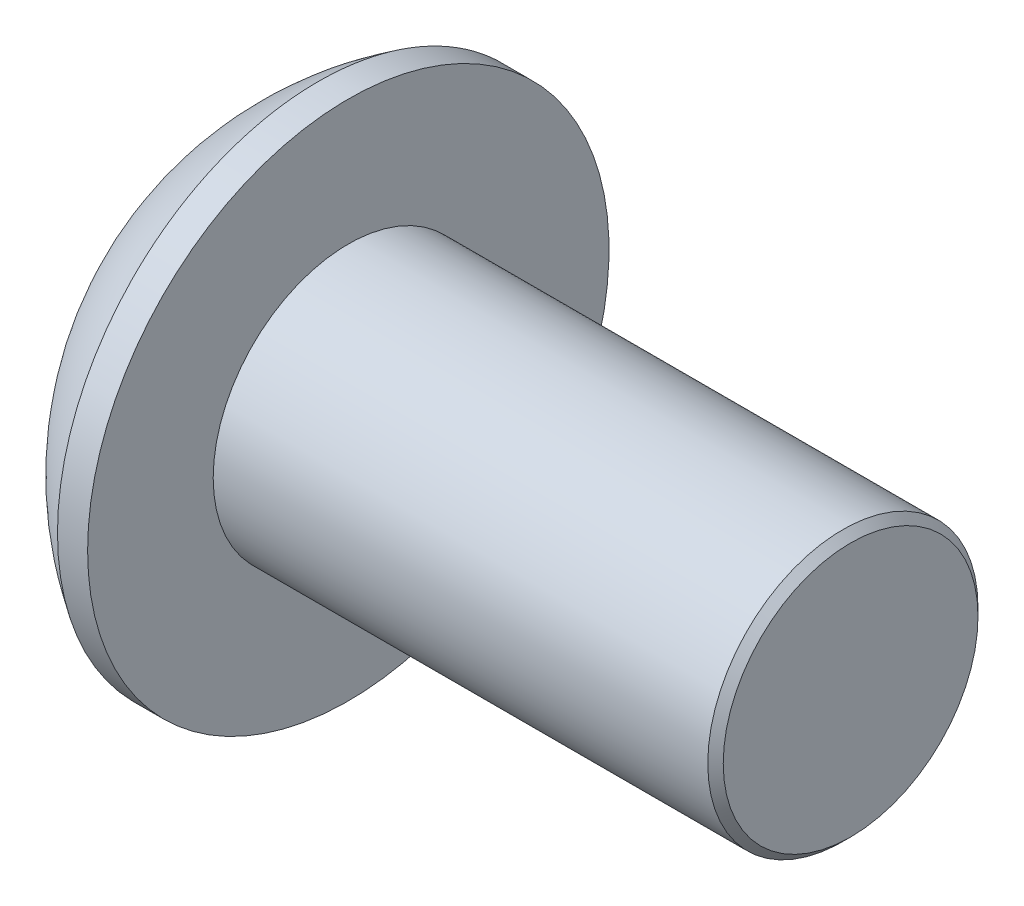
ISO-10303-21;
HEADER;
FILE_DESCRIPTION(('STEP AP214'),'2;1');
FILE_NAME('part.step','',(''),(''),'','','');
FILE_SCHEMA(('AUTOMOTIVE_DESIGN { 1 0 10303 214 1 1 1 1 }'));
ENDSEC;
DATA;
#1=APPLICATION_CONTEXT('core data for automotive mechanical design processes');
#2=APPLICATION_PROTOCOL_DEFINITION('international standard','automotive_design',2000,#1);
#3=PRODUCT_CONTEXT('',#1,'mechanical');
#4=PRODUCT('Part','Part','',(#3));
#5=PRODUCT_RELATED_PRODUCT_CATEGORY('part','',(#4));
#6=PRODUCT_DEFINITION_FORMATION('','',#4);
#7=PRODUCT_DEFINITION_CONTEXT('part definition',#1,'design');
#8=PRODUCT_DEFINITION('design','',#6,#7);
#9=PRODUCT_DEFINITION_SHAPE('','',#8);
#10=(LENGTH_UNIT() NAMED_UNIT(*) SI_UNIT(.MILLI.,.METRE.));
#11=(NAMED_UNIT(*) PLANE_ANGLE_UNIT() SI_UNIT($,.RADIAN.));
#12=(NAMED_UNIT(*) SI_UNIT($,.STERADIAN.) SOLID_ANGLE_UNIT());
#13=UNCERTAINTY_MEASURE_WITH_UNIT(LENGTH_MEASURE(1.E-05),#10,'distance_accuracy_value','');
#14=(GEOMETRIC_REPRESENTATION_CONTEXT(3) GLOBAL_UNCERTAINTY_ASSIGNED_CONTEXT((#13)) GLOBAL_UNIT_ASSIGNED_CONTEXT((#10,
#11,#12)) REPRESENTATION_CONTEXT('',''));
#15=CARTESIAN_POINT('',(0.,0.,0.));
#16=DIRECTION('',(0.,0.,1.));
#17=DIRECTION('',(1.,0.,0.));
#18=AXIS2_PLACEMENT_3D('',#15,#16,#17);
#19=CARTESIAN_POINT('',(1.32080000000034,0.,0.));
#20=DIRECTION('',(-1.,0.,0.));
#21=DIRECTION('',(0.,0.,1.));
#22=AXIS2_PLACEMENT_3D('',#19,#20,#21);
#23=CONICAL_SURFACE('',#22,1.1937999999998,1.04719755119608);
#24=CARTESIAN_POINT('',(2.01004075135902,0.,4.44089209850063E-13));
#25=VERTEX_POINT('',#24);
#26=VERTEX_LOOP('',#25);
#27=FACE_BOUND('',#26,.T.);
#28=CARTESIAN_POINT('',(1.32080000000009,0.,0.));
#29=DIRECTION('',(-1.,0.,0.));
#30=DIRECTION('',(0.,0.,1.));
#31=AXIS2_PLACEMENT_3D('',#28,#29,#30);
#32=CIRCLE('',#31,1.19380000000024);
#33=CARTESIAN_POINT('',(1.32080000000004,-1.03386112703797,0.59690000000006));
#34=VERTEX_POINT('',#33);
#35=CARTESIAN_POINT('',(1.32080000000004,0.,1.19380000000012));
#36=VERTEX_POINT('',#35);
#37=EDGE_CURVE('E20',#34,#36,#32,.T.);
#38=ORIENTED_EDGE('',*,*,#37,.T.);
#39=CARTESIAN_POINT('',(1.32080000000009,0.,0.));
#40=DIRECTION('',(-1.,0.,0.));
#41=DIRECTION('',(0.,0.,1.));
#42=AXIS2_PLACEMENT_3D('',#39,#40,#41);
#43=CIRCLE('',#42,1.19380000000024);
#44=CARTESIAN_POINT('',(1.32080000000004,1.03386112703797,0.596900000000061));
#45=VERTEX_POINT('',#44);
#46=EDGE_CURVE('E148',#36,#45,#43,.T.);
#47=ORIENTED_EDGE('',*,*,#46,.T.);
#48=CARTESIAN_POINT('',(1.32080000000009,0.,0.));
#49=DIRECTION('',(-1.,0.,0.));
#50=DIRECTION('',(0.,0.,1.));
#51=AXIS2_PLACEMENT_3D('',#48,#49,#50);
#52=CIRCLE('',#51,1.19380000000024);
#53=CARTESIAN_POINT('',(1.32080000000004,1.03386112703797,-0.596900000000061));
#54=VERTEX_POINT('',#53);
#55=EDGE_CURVE('E403',#45,#54,#52,.T.);
#56=ORIENTED_EDGE('',*,*,#55,.T.);
#57=CARTESIAN_POINT('',(1.32080000000009,0.,0.));
#58=DIRECTION('',(-1.,0.,0.));
#59=DIRECTION('',(0.,0.,1.));
#60=AXIS2_PLACEMENT_3D('',#57,#58,#59);
#61=CIRCLE('',#60,1.19380000000024);
#62=CARTESIAN_POINT('',(1.32080000000004,1.49457637585666E-12,-1.19380000000012));
#63=VERTEX_POINT('',#62);
#64=EDGE_CURVE('E404',#54,#63,#61,.T.);
#65=ORIENTED_EDGE('',*,*,#64,.T.);
#66=CARTESIAN_POINT('',(1.32080000000009,0.,0.));
#67=DIRECTION('',(-1.,0.,0.));
#68=DIRECTION('',(0.,0.,1.));
#69=AXIS2_PLACEMENT_3D('',#66,#67,#68);
#70=CIRCLE('',#69,1.19380000000024);
#71=CARTESIAN_POINT('',(1.32080000000004,-1.03386112703797,-0.59690000000006));
#72=VERTEX_POINT('',#71);
#73=EDGE_CURVE('E93',#63,#72,#70,.T.);
#74=ORIENTED_EDGE('',*,*,#73,.T.);
#75=CARTESIAN_POINT('',(1.32080000000009,0.,0.));
#76=DIRECTION('',(-1.,0.,0.));
#77=DIRECTION('',(0.,0.,1.));
#78=AXIS2_PLACEMENT_3D('',#75,#76,#77);
#79=CIRCLE('',#78,1.19380000000024);
#80=EDGE_CURVE('E89',#72,#34,#79,.T.);
#81=ORIENTED_EDGE('',*,*,#80,.T.);
#82=EDGE_LOOP('',(#38,#47,#56,#65,#74,#81));
#83=FACE_BOUND('',#82,.T.);
#84=ADVANCED_FACE('F17',(#27,#83),#23,.F.);
#85=CARTESIAN_POINT('',(1.3208,-2.06772225407572,-1.1938));
#86=DIRECTION('',(1.,0.,0.));
#87=DIRECTION('',(0.,0.,-1.));
#88=AXIS2_PLACEMENT_3D('',#85,#86,#87);
#89=PLANE('',#88);
#90=DIRECTION('',(0.,0.5,0.866025403784439));
#91=VECTOR('',#90,1.);
#92=CARTESIAN_POINT('',(1.3208,-1.37848150271715,0.));
#93=LINE('',#92,#91);
#94=CARTESIAN_POINT('',(1.3208,-0.689240751358574,1.1938));
#95=VERTEX_POINT('',#94);
#96=EDGE_CURVE('E101',#95,#34,#93,.F.);
#97=ORIENTED_EDGE('',*,*,#96,.F.);
#98=DIRECTION('',(0.,1.,0.));
#99=VECTOR('',#98,1.);
#100=CARTESIAN_POINT('',(1.3208,-0.689240751358574,1.1938));
#101=LINE('',#100,#99);
#102=EDGE_CURVE('E103',#36,#95,#101,.F.);
#103=ORIENTED_EDGE('',*,*,#102,.F.);
#104=ORIENTED_EDGE('',*,*,#37,.F.);
#105=EDGE_LOOP('',(#97,#103,#104));
#106=FACE_BOUND('',#105,.T.);
#107=ADVANCED_FACE('F99',(#106),#89,.F.);
#108=CARTESIAN_POINT('',(1.3208,-2.06772225407572,-1.1938));
#109=DIRECTION('',(1.,0.,0.));
#110=DIRECTION('',(0.,0.,-1.));
#111=AXIS2_PLACEMENT_3D('',#108,#109,#110);
#112=PLANE('',#111);
#113=DIRECTION('',(0.,-0.5,0.866025403784439));
#114=VECTOR('',#113,1.);
#115=CARTESIAN_POINT('',(1.3208,-0.689240751358574,-1.1938));
#116=LINE('',#115,#114);
#117=CARTESIAN_POINT('',(1.3208,-1.37848150271715,0.));
#118=VERTEX_POINT('',#117);
#119=EDGE_CURVE('E109',#118,#72,#116,.F.);
#120=ORIENTED_EDGE('',*,*,#119,.F.);
#121=DIRECTION('',(0.,0.5,0.866025403784439));
#122=VECTOR('',#121,1.);
#123=CARTESIAN_POINT('',(1.3208,-1.37848150271715,0.));
#124=LINE('',#123,#122);
#125=EDGE_CURVE('E106',#34,#118,#124,.F.);
#126=ORIENTED_EDGE('',*,*,#125,.F.);
#127=ORIENTED_EDGE('',*,*,#80,.F.);
#128=EDGE_LOOP('',(#120,#126,#127));
#129=FACE_BOUND('',#128,.T.);
#130=ADVANCED_FACE('F107',(#129),#112,.F.);
#131=CARTESIAN_POINT('',(1.3208,-2.06772225407572,-1.1938));
#132=DIRECTION('',(1.,0.,0.));
#133=DIRECTION('',(0.,0.,-1.));
#134=AXIS2_PLACEMENT_3D('',#131,#132,#133);
#135=PLANE('',#134);
#136=DIRECTION('',(0.,1.,0.));
#137=VECTOR('',#136,1.);
#138=CARTESIAN_POINT('',(1.3208,0.689240751358577,-1.1938));
#139=LINE('',#138,#137);
#140=CARTESIAN_POINT('',(1.3208,-0.689240751358574,-1.1938));
#141=VERTEX_POINT('',#140);
#142=EDGE_CURVE('E374',#141,#63,#139,.T.);
#143=ORIENTED_EDGE('',*,*,#142,.F.);
#144=DIRECTION('',(0.,-0.5,0.866025403784439));
#145=VECTOR('',#144,1.);
#146=CARTESIAN_POINT('',(1.3208,-0.689240751358574,-1.1938));
#147=LINE('',#146,#145);
#148=EDGE_CURVE('E386',#72,#141,#147,.F.);
#149=ORIENTED_EDGE('',*,*,#148,.F.);
#150=ORIENTED_EDGE('',*,*,#73,.F.);
#151=EDGE_LOOP('',(#143,#149,#150));
#152=FACE_BOUND('',#151,.T.);
#153=ADVANCED_FACE('F191',(#152),#135,.F.);
#154=CARTESIAN_POINT('',(1.3208,-2.06772225407572,-1.1938));
#155=DIRECTION('',(1.,0.,0.));
#156=DIRECTION('',(0.,0.,-1.));
#157=AXIS2_PLACEMENT_3D('',#154,#155,#156);
#158=PLANE('',#157);
#159=DIRECTION('',(0.,-0.5,-0.866025403784439));
#160=VECTOR('',#159,1.);
#161=CARTESIAN_POINT('',(1.3208,1.37848150271715,0.));
#162=LINE('',#161,#160);
#163=CARTESIAN_POINT('',(1.3208,0.689240751358577,-1.1938));
#164=VERTEX_POINT('',#163);
#165=EDGE_CURVE('E360',#164,#54,#162,.F.);
#166=ORIENTED_EDGE('',*,*,#165,.F.);
#167=DIRECTION('',(0.,1.,0.));
#168=VECTOR('',#167,1.);
#169=CARTESIAN_POINT('',(1.3208,0.689240751358577,-1.1938));
#170=LINE('',#169,#168);
#171=EDGE_CURVE('E371',#63,#164,#170,.T.);
#172=ORIENTED_EDGE('',*,*,#171,.F.);
#173=ORIENTED_EDGE('',*,*,#64,.F.);
#174=EDGE_LOOP('',(#166,#172,#173));
#175=FACE_BOUND('',#174,.T.);
#176=ADVANCED_FACE('F187',(#175),#158,.F.);
#177=CARTESIAN_POINT('',(1.3208,-2.06772225407572,-1.1938));
#178=DIRECTION('',(1.,0.,0.));
#179=DIRECTION('',(0.,0.,-1.));
#180=AXIS2_PLACEMENT_3D('',#177,#178,#179);
#181=PLANE('',#180);
#182=DIRECTION('',(0.,0.5,-0.866025403784439));
#183=VECTOR('',#182,1.);
#184=CARTESIAN_POINT('',(1.3208,0.689240751358576,1.1938));
#185=LINE('',#184,#183);
#186=CARTESIAN_POINT('',(1.3208,1.37848150271715,0.));
#187=VERTEX_POINT('',#186);
#188=EDGE_CURVE('E339',#187,#45,#185,.F.);
#189=ORIENTED_EDGE('',*,*,#188,.F.);
#190=DIRECTION('',(0.,-0.5,-0.866025403784439));
#191=VECTOR('',#190,1.);
#192=CARTESIAN_POINT('',(1.3208,1.37848150271715,0.));
#193=LINE('',#192,#191);
#194=EDGE_CURVE('E358',#54,#187,#193,.F.);
#195=ORIENTED_EDGE('',*,*,#194,.F.);
#196=ORIENTED_EDGE('',*,*,#55,.F.);
#197=EDGE_LOOP('',(#189,#195,#196));
#198=FACE_BOUND('',#197,.T.);
#199=ADVANCED_FACE('F183',(#198),#181,.F.);
#200=CARTESIAN_POINT('',(1.3208,-2.06772225407572,-1.1938));
#201=DIRECTION('',(1.,0.,0.));
#202=DIRECTION('',(0.,0.,-1.));
#203=AXIS2_PLACEMENT_3D('',#200,#201,#202);
#204=PLANE('',#203);
#205=DIRECTION('',(0.,1.,0.));
#206=VECTOR('',#205,1.);
#207=CARTESIAN_POINT('',(1.3208,-0.689240751358574,1.1938));
#208=LINE('',#207,#206);
#209=CARTESIAN_POINT('',(1.3208,0.689240751358576,1.1938));
#210=VERTEX_POINT('',#209);
#211=EDGE_CURVE('E118',#210,#36,#208,.F.);
#212=ORIENTED_EDGE('',*,*,#211,.F.);
#213=DIRECTION('',(0.,0.5,-0.866025403784439));
#214=VECTOR('',#213,1.);
#215=CARTESIAN_POINT('',(1.3208,0.689240751358576,1.1938));
#216=LINE('',#215,#214);
#217=EDGE_CURVE('E342',#45,#210,#216,.F.);
#218=ORIENTED_EDGE('',*,*,#217,.F.);
#219=ORIENTED_EDGE('',*,*,#46,.F.);
#220=EDGE_LOOP('',(#212,#218,#219));
#221=FACE_BOUND('',#220,.T.);
#222=ADVANCED_FACE('F179',(#221),#204,.F.);
#223=CARTESIAN_POINT('',(1.3208,-0.689240751358574,1.1938));
#224=DIRECTION('',(0.,0.,-1.));
#225=DIRECTION('',(0.,1.,0.));
#226=AXIS2_PLACEMENT_3D('',#223,#224,#225);
#227=PLANE('',#226);
#228=DIRECTION('',(0.,1.,0.));
#229=VECTOR('',#228,1.);
#230=CARTESIAN_POINT('',(0.,0.,1.1938));
#231=LINE('',#230,#229);
#232=CARTESIAN_POINT('',(0.,0.689240751358577,1.1938));
#233=VERTEX_POINT('',#232);
#234=CARTESIAN_POINT('',(0.,-0.689240751358574,1.1938));
#235=VERTEX_POINT('',#234);
#236=EDGE_CURVE('E336',#233,#235,#231,.F.);
#237=ORIENTED_EDGE('',*,*,#236,.F.);
#238=DIRECTION('',(1.,0.,0.));
#239=VECTOR('',#238,1.);
#240=CARTESIAN_POINT('',(1.3208,0.689240751358576,1.1938));
#241=LINE('',#240,#239);
#242=EDGE_CURVE('E348',#210,#233,#241,.F.);
#243=ORIENTED_EDGE('',*,*,#242,.F.);
#244=ORIENTED_EDGE('',*,*,#211,.T.);
#245=ORIENTED_EDGE('',*,*,#102,.T.);
#246=DIRECTION('',(1.,0.,0.));
#247=VECTOR('',#246,1.);
#248=CARTESIAN_POINT('',(1.3208,-0.689240751358574,1.1938));
#249=LINE('',#248,#247);
#250=EDGE_CURVE('E112',#235,#95,#249,.T.);
#251=ORIENTED_EDGE('',*,*,#250,.F.);
#252=EDGE_LOOP('',(#237,#243,#244,#245,#251));
#253=FACE_BOUND('',#252,.T.);
#254=ADVANCED_FACE('F176',(#253),#227,.T.);
#255=CARTESIAN_POINT('',(1.3208,-1.37848150271715,0.));
#256=DIRECTION('',(0.,0.866025403784439,-0.5));
#257=DIRECTION('',(0.,0.5,0.866025403784439));
#258=AXIS2_PLACEMENT_3D('',#255,#256,#257);
#259=PLANE('',#258);
#260=DIRECTION('',(0.,-0.5,-0.866025403784439));
#261=VECTOR('',#260,1.);
#262=CARTESIAN_POINT('',(0.,-0.689240751358574,1.1938));
#263=LINE('',#262,#261);
#264=CARTESIAN_POINT('',(0.,-1.37848150271715,0.));
#265=VERTEX_POINT('',#264);
#266=EDGE_CURVE('E333',#235,#265,#263,.T.);
#267=ORIENTED_EDGE('',*,*,#266,.F.);
#268=ORIENTED_EDGE('',*,*,#250,.T.);
#269=ORIENTED_EDGE('',*,*,#96,.T.);
#270=ORIENTED_EDGE('',*,*,#125,.T.);
#271=DIRECTION('',(1.,0.,0.));
#272=VECTOR('',#271,1.);
#273=CARTESIAN_POINT('',(1.3208,-1.37848150271715,0.));
#274=LINE('',#273,#272);
#275=EDGE_CURVE('E383',#265,#118,#274,.T.);
#276=ORIENTED_EDGE('',*,*,#275,.F.);
#277=EDGE_LOOP('',(#267,#268,#269,#270,#276));
#278=FACE_BOUND('',#277,.T.);
#279=ADVANCED_FACE('F116',(#278),#259,.T.);
#280=CARTESIAN_POINT('',(1.3208,-0.689240751358574,-1.1938));
#281=DIRECTION('',(0.,0.866025403784439,0.5));
#282=DIRECTION('',(0.,-0.5,0.866025403784439));
#283=AXIS2_PLACEMENT_3D('',#280,#281,#282);
#284=PLANE('',#283);
#285=DIRECTION('',(0.,0.5,-0.866025403784439));
#286=VECTOR('',#285,1.);
#287=CARTESIAN_POINT('',(0.,-1.37848150271715,0.));
#288=LINE('',#287,#286);
#289=CARTESIAN_POINT('',(0.,-0.689240751358574,-1.1938));
#290=VERTEX_POINT('',#289);
#291=EDGE_CURVE('E330',#265,#290,#288,.T.);
#292=ORIENTED_EDGE('',*,*,#291,.F.);
#293=ORIENTED_EDGE('',*,*,#275,.T.);
#294=ORIENTED_EDGE('',*,*,#119,.T.);
#295=ORIENTED_EDGE('',*,*,#148,.T.);
#296=DIRECTION('',(1.,0.,0.));
#297=VECTOR('',#296,1.);
#298=CARTESIAN_POINT('',(1.3208,-0.689240751358574,-1.1938));
#299=LINE('',#298,#297);
#300=EDGE_CURVE('E368',#290,#141,#299,.T.);
#301=ORIENTED_EDGE('',*,*,#300,.F.);
#302=EDGE_LOOP('',(#292,#293,#294,#295,#301));
#303=FACE_BOUND('',#302,.T.);
#304=ADVANCED_FACE('F169',(#303),#284,.T.);
#305=CARTESIAN_POINT('',(1.3208,0.689240751358577,-1.1938));
#306=DIRECTION('',(0.,0.,1.));
#307=DIRECTION('',(1.,0.,0.));
#308=AXIS2_PLACEMENT_3D('',#305,#306,#307);
#309=PLANE('',#308);
#310=DIRECTION('',(0.,1.,0.));
#311=VECTOR('',#310,1.);
#312=CARTESIAN_POINT('',(0.,0.,-1.1938));
#313=LINE('',#312,#311);
#314=CARTESIAN_POINT('',(0.,0.689240751358577,-1.1938));
#315=VERTEX_POINT('',#314);
#316=EDGE_CURVE('E327',#290,#315,#313,.T.);
#317=ORIENTED_EDGE('',*,*,#316,.F.);
#318=ORIENTED_EDGE('',*,*,#300,.T.);
#319=ORIENTED_EDGE('',*,*,#142,.T.);
#320=ORIENTED_EDGE('',*,*,#171,.T.);
#321=DIRECTION('',(1.,0.,0.));
#322=VECTOR('',#321,1.);
#323=CARTESIAN_POINT('',(1.3208,0.689240751358577,-1.1938));
#324=LINE('',#323,#322);
#325=EDGE_CURVE('E343',#315,#164,#324,.T.);
#326=ORIENTED_EDGE('',*,*,#325,.F.);
#327=EDGE_LOOP('',(#317,#318,#319,#320,#326));
#328=FACE_BOUND('',#327,.T.);
#329=ADVANCED_FACE('F166',(#328),#309,.T.);
#330=CARTESIAN_POINT('',(1.3208,1.37848150271715,0.));
#331=DIRECTION('',(0.,-0.866025403784439,0.5));
#332=DIRECTION('',(0.,-0.5,-0.866025403784439));
#333=AXIS2_PLACEMENT_3D('',#330,#331,#332);
#334=PLANE('',#333);
#335=DIRECTION('',(0.,0.5,0.866025403784439));
#336=VECTOR('',#335,1.);
#337=CARTESIAN_POINT('',(0.,0.689240751358577,-1.1938));
#338=LINE('',#337,#336);
#339=CARTESIAN_POINT('',(0.,1.37848150271715,0.));
#340=VERTEX_POINT('',#339);
#341=EDGE_CURVE('E324',#315,#340,#338,.T.);
#342=ORIENTED_EDGE('',*,*,#341,.F.);
#343=ORIENTED_EDGE('',*,*,#325,.T.);
#344=ORIENTED_EDGE('',*,*,#165,.T.);
#345=ORIENTED_EDGE('',*,*,#194,.T.);
#346=DIRECTION('',(1.,0.,0.));
#347=VECTOR('',#346,1.);
#348=CARTESIAN_POINT('',(1.3208,1.37848150271715,0.));
#349=LINE('',#348,#347);
#350=EDGE_CURVE('E35',#340,#187,#349,.T.);
#351=ORIENTED_EDGE('',*,*,#350,.F.);
#352=EDGE_LOOP('',(#342,#343,#344,#345,#351));
#353=FACE_BOUND('',#352,.T.);
#354=ADVANCED_FACE('F162',(#353),#334,.T.);
#355=CARTESIAN_POINT('',(1.3208,0.689240751358576,1.1938));
#356=DIRECTION('',(0.,-0.866025403784439,-0.5));
#357=DIRECTION('',(0.,0.5,-0.866025403784439));
#358=AXIS2_PLACEMENT_3D('',#355,#356,#357);
#359=PLANE('',#358);
#360=DIRECTION('',(0.,-0.5,0.866025403784439));
#361=VECTOR('',#360,1.);
#362=CARTESIAN_POINT('',(0.,1.37848150271715,0.));
#363=LINE('',#362,#361);
#364=EDGE_CURVE('E147',#340,#233,#363,.T.);
#365=ORIENTED_EDGE('',*,*,#364,.F.);
#366=ORIENTED_EDGE('',*,*,#350,.T.);
#367=ORIENTED_EDGE('',*,*,#188,.T.);
#368=ORIENTED_EDGE('',*,*,#217,.T.);
#369=ORIENTED_EDGE('',*,*,#242,.T.);
#370=EDGE_LOOP('',(#365,#366,#367,#368,#369));
#371=FACE_BOUND('',#370,.T.);
#372=ADVANCED_FACE('F158',(#371),#359,.T.);
#373=CARTESIAN_POINT('',(0.,0.,0.));
#374=DIRECTION('',(-1.,0.,0.));
#375=DIRECTION('',(0.,0.,1.));
#376=AXIS2_PLACEMENT_3D('',#373,#374,#375);
#377=PLANE('',#376);
#378=ORIENTED_EDGE('',*,*,#341,.T.);
#379=ORIENTED_EDGE('',*,*,#364,.T.);
#380=ORIENTED_EDGE('',*,*,#236,.T.);
#381=ORIENTED_EDGE('',*,*,#266,.T.);
#382=ORIENTED_EDGE('',*,*,#291,.T.);
#383=ORIENTED_EDGE('',*,*,#316,.T.);
#384=EDGE_LOOP('',(#378,#379,#380,#381,#382,#383));
#385=FACE_BOUND('',#384,.T.);
#386=CARTESIAN_POINT('',(0.,1.647825,0.));
#387=CARTESIAN_POINT('',(1.63319194702151E-13,1.64781976319874,0.092490203977753));
#388=CARTESIAN_POINT('',(1.32890083579297E-13,1.63999511633709,0.18514501432637));
#389=CARTESIAN_POINT('',(0.,1.6167119250047,0.322075808080013));
#390=CARTESIAN_POINT('',(-1.58500729597375E-13,1.60700618770234,0.36743553339636));
#391=CARTESIAN_POINT('',(1.59063479291743E-13,1.58380101865853,0.45722093569514));
#392=CARTESIAN_POINT('',(5.6924253476393E-13,1.5702985083103,0.501645823115263));
#393=CARTESIAN_POINT('',(9.37393023603841E-13,1.52428156574313,0.632817459278967));
#394=CARTESIAN_POINT('',(0.,1.48621992666366,0.717681965518643));
#395=CARTESIAN_POINT('',(0.,1.39637079695658,0.879809706624016));
#396=CARTESIAN_POINT('',(7.82184274151218E-13,1.34458278455109,0.957072652379995));
#397=CARTESIAN_POINT('',(4.86982737501784E-13,1.25777784714521,1.06558770210237));
#398=CARTESIAN_POINT('',(1.33453761487452E-13,1.22729946114794,1.10054993332365));
#399=CARTESIAN_POINT('',(-1.3289162015903E-13,1.16354004969106,1.16775237388221));
#400=CARTESIAN_POINT('',(0.,1.13026175473033,1.19999517515816));
#401=CARTESIAN_POINT('',(0.,1.02649304340867,1.29236218866442));
#402=CARTESIAN_POINT('',(0.,0.952049986714077,1.34814848277712));
#403=CARTESIAN_POINT('',(0.,0.794895196754067,1.44639825105765));
#404=CARTESIAN_POINT('',(0.,0.712183775431296,1.48886222758992));
#405=CARTESIAN_POINT('',(0.,0.540796624265731,1.55930919813143));
#406=CARTESIAN_POINT('',(0.,0.452120958135287,1.58729234680268));
#407=CARTESIAN_POINT('',(0.,0.271332331080319,1.62797191307413));
#408=CARTESIAN_POINT('',(0.,0.179219351801791,1.64066824903626));
#409=CARTESIAN_POINT('',(0.,-0.0058307702784061,1.65041748705408));
#410=CARTESIAN_POINT('',(0.,-0.0987679130800752,1.64747038910978));
#411=CARTESIAN_POINT('',(0.,-0.282830196388822,1.62601274134435));
#412=CARTESIAN_POINT('',(0.,-0.373955346570016,1.60750227463794));
#413=CARTESIAN_POINT('',(0.,-0.551796068178801,1.55545413364523));
#414=CARTESIAN_POINT('',(0.,-0.638511592498163,1.52191629885843));
#415=CARTESIAN_POINT('',(0.,-0.805120175533149,1.44072378052346));
#416=CARTESIAN_POINT('',(0.,-0.885012976819951,1.39306856461393));
#417=CARTESIAN_POINT('',(0.,-0.997912879588355,1.31211658756413));
#418=CARTESIAN_POINT('',(0.,-1.0343949246834,1.28354906167734));
#419=CARTESIAN_POINT('',(0.,-1.10486279842068,1.22341829303709));
#420=CARTESIAN_POINT('',(0.,-1.13884618403291,1.19185218578117));
#421=CARTESIAN_POINT('',(0.,-1.23657300939908,1.09305906467359));
#422=CARTESIAN_POINT('',(0.,-1.29619288399356,1.02166556658612));
#423=CARTESIAN_POINT('',(0.,-1.40258050817755,0.869876423478031));
#424=CARTESIAN_POINT('',(0.,-1.44934874627766,0.789481120793477));
#425=CARTESIAN_POINT('',(0.,-1.50889406070375,0.66387095931334));
#426=CARTESIAN_POINT('',(0.,-1.52698985473586,0.621110806760426));
#427=CARTESIAN_POINT('',(0.,-1.55950093966664,0.53426077686433));
#428=CARTESIAN_POINT('',(-1.05235362596779E-13,-1.57391920916438,0.490172008203167));
#429=CARTESIAN_POINT('',(2.10568324685354E-13,-1.61146177909579,0.356445777718595));
#430=CARTESIAN_POINT('',(1.14396658334039E-12,-1.62897899568074,0.265126085962904));
#431=CARTESIAN_POINT('',(4.347347107204E-13,-1.64174347214908,0.144386595969386));
#432=CARTESIAN_POINT('',(1.21682740895759E-13,-1.64402207668915,0.115560405797873));
#433=CARTESIAN_POINT('',(-1.21249060026839E-13,-1.6470636594012,0.0578281757252688));
#434=CARTESIAN_POINT('',(0.,-1.64782663757318,0.0289221358241775));
#435=CARTESIAN_POINT('',(1.63505268006993E-13,-1.64781976319874,-0.0924902039777536));
#436=CARTESIAN_POINT('',(1.32794566155401E-13,-1.63999511633709,-0.18514501432637));
#437=CARTESIAN_POINT('',(0.,-1.6167119250047,-0.322075808080014));
#438=CARTESIAN_POINT('',(-1.58310187784522E-13,-1.60700618770234,-0.367435533396361));
#439=CARTESIAN_POINT('',(1.58872782530651E-13,-1.58380101865853,-0.45722093569514));
#440=CARTESIAN_POINT('',(5.68527399730162E-13,-1.5702985083103,-0.501645823115263));
#441=CARTESIAN_POINT('',(9.36221934104128E-13,-1.52428156574313,-0.632817459278966));
#442=CARTESIAN_POINT('',(0.,-1.48621992666366,-0.717681965518643));
#443=CARTESIAN_POINT('',(0.,-1.39637079695658,-0.879809706624015));
#444=CARTESIAN_POINT('',(7.809853327574E-13,-1.34458278455109,-0.957072652379992));
#445=CARTESIAN_POINT('',(4.86281382838322E-13,-1.25777784714521,-1.06558770210237));
#446=CARTESIAN_POINT('',(1.33300307899813E-13,-1.22729946114794,-1.10054993332365));
#447=CARTESIAN_POINT('',(-1.32738314523763E-13,-1.16354004969107,-1.16775237388221));
#448=CARTESIAN_POINT('',(0.,-1.13026175473033,-1.19999517515816));
#449=CARTESIAN_POINT('',(0.,-1.02649304340867,-1.29236218866442));
#450=CARTESIAN_POINT('',(0.,-0.952049986714081,-1.34814848277713));
#451=CARTESIAN_POINT('',(0.,-0.794895196754072,-1.44639825105765));
#452=CARTESIAN_POINT('',(0.,-0.7121837754313,-1.48886222758991));
#453=CARTESIAN_POINT('',(0.,-0.540796624265734,-1.55930919813143));
#454=CARTESIAN_POINT('',(0.,-0.452120958135291,-1.58729234680268));
#455=CARTESIAN_POINT('',(0.,-0.271332331080322,-1.62797191307413));
#456=CARTESIAN_POINT('',(0.,-0.179219351801793,-1.64066824903626));
#457=CARTESIAN_POINT('',(0.,0.00583077027840386,-1.65041748705408));
#458=CARTESIAN_POINT('',(0.,0.0987679130800731,-1.64747038910978));
#459=CARTESIAN_POINT('',(0.,0.28283019638882,-1.62601274134436));
#460=CARTESIAN_POINT('',(0.,0.373955346570014,-1.60750227463794));
#461=CARTESIAN_POINT('',(0.,0.551796068178799,-1.55545413364523));
#462=CARTESIAN_POINT('',(0.,0.638511592498161,-1.52191629885844));
#463=CARTESIAN_POINT('',(0.,0.805120175533147,-1.44072378052347));
#464=CARTESIAN_POINT('',(0.,0.885012976819949,-1.39306856461393));
#465=CARTESIAN_POINT('',(0.,0.997912879588353,-1.31211658756413));
#466=CARTESIAN_POINT('',(0.,1.03439492468339,-1.28354906167734));
#467=CARTESIAN_POINT('',(0.,1.10486279842068,-1.22341829303709));
#468=CARTESIAN_POINT('',(0.,1.1388461840329,-1.19185218578117));
#469=CARTESIAN_POINT('',(0.,1.23657300939908,-1.09305906467358));
#470=CARTESIAN_POINT('',(0.,1.29619288399356,-1.02166556658612));
#471=CARTESIAN_POINT('',(0.,1.40258050817755,-0.869876423478032));
#472=CARTESIAN_POINT('',(0.,1.44934874627765,-0.789481120793476));
#473=CARTESIAN_POINT('',(0.,1.50889406070375,-0.66387095931334));
#474=CARTESIAN_POINT('',(0.,1.52698985473586,-0.621110806760427));
#475=CARTESIAN_POINT('',(0.,1.55950093966664,-0.534260776864331));
#476=CARTESIAN_POINT('',(-1.05163336027755E-13,1.57391920916437,-0.490172008203168));
#477=CARTESIAN_POINT('',(2.10424649207135E-13,1.61146177909579,-0.356445777718595));
#478=CARTESIAN_POINT('',(1.1439193518672E-12,1.62897899568074,-0.265126085962905));
#479=CARTESIAN_POINT('',(4.34749480231378E-13,1.64174347214908,-0.144386595969387));
#480=CARTESIAN_POINT('',(1.21707467703441E-13,1.64402207668915,-0.115560405797874));
#481=CARTESIAN_POINT('',(-1.21273786834522E-13,1.6470636594012,-0.0578281757252697));
#482=CARTESIAN_POINT('',(0.,1.64782663757318,-0.0289221358241784));
#483=CARTESIAN_POINT('',(0.,1.647825,0.));
#484=B_SPLINE_CURVE_WITH_KNOTS('',3,(#386,#387,#388,#389,#390,#391,#392,#393,#394,#395,#396,
#397,#398,#399,#400,#401,#402,#403,#404,#405,#406,#407,#408,#409,#410,#411,#412,#413,#414,#415,
#416,#417,#418,#419,#420,#421,#422,#423,#424,#425,#426,#427,#428,#429,#430,#431,#432,#433,#434,
#435,#436,#437,#438,#439,#440,#441,#442,#443,#444,#445,#446,#447,#448,#449,#450,#451,#452,#453,
#454,#455,#456,#457,#458,#459,#460,#461,#462,#463,#464,#465,#466,#467,#468,#469,#470,#471,#472,
#473,#474,#475,#476,#477,#478,#479,#480,#481,#482,#483),.UNSPECIFIED.,.T.,.F.,(4,2,2,2,2,2,2,2,
2,2,2,2,2,2,2,2,2,2,2,2,2,2,2,2,2,2,2,2,2,2,2,2,2,2,2,2,2,2,2,2,2,2,2,2,2,2,2,2,4),(0.,
0.277336029422426,0.416368541537111,0.5555141146256,0.833141970294986,1.11078038089036,
1.24978149120748,1.38864858351854,1.66629367015056,1.94392828594775,2.22155993641642,
2.49919306954937,2.77682620268234,3.05445785315101,3.3320924689482,3.6097375555799,
3.74860464789074,3.88760575820767,4.16524416880332,4.44287202447287,4.5820175975616,
4.72105010967662,4.99838613909882,5.08511046196677,5.17183478483476,5.44917081425719,
5.58820332637187,5.72734889946036,6.00497675512975,6.28261516572512,6.42161627604224,
6.5604833683533,6.83812845498532,7.11576307078251,7.39339472125118,7.67102785438413,
7.9486609875171,8.22629263798578,8.50392725378296,8.78157234041466,8.9204394327255,
9.05944054304243,9.33707895363808,9.61470680930763,9.75385238239637,9.89288489451138,
10.1702209239336,10.2569452468015,10.3436695696695),.UNSPECIFIED.);
#485=CARTESIAN_POINT('',(0.,1.647825,0.));
#486=VERTEX_POINT('',#485);
#487=EDGE_CURVE('E140',#486,#486,#484,.T.);
#488=ORIENTED_EDGE('',*,*,#487,.F.);
#489=EDGE_LOOP('',(#488));
#490=FACE_BOUND('',#489,.T.);
#491=ADVANCED_FACE('F154',(#385,#490),#377,.T.);
#492=CARTESIAN_POINT('',(3.50132362607759,0.,0.));
#493=DIRECTION('',(0.,1.,0.));
#494=DIRECTION('',(1.,0.,0.));
#495=AXIS2_PLACEMENT_3D('',#492,#493,#494);
#496=SPHERICAL_SURFACE('',#495,3.86970210289553);
#497=CARTESIAN_POINT('',(1.4732,0.,0.));
#498=DIRECTION('',(-1.,0.,0.));
#499=DIRECTION('',(0.,0.,1.));
#500=AXIS2_PLACEMENT_3D('',#497,#498,#499);
#501=CIRCLE('',#500,3.29565);
#502=CARTESIAN_POINT('',(1.4732,0.,3.29565));
#503=VERTEX_POINT('',#502);
#504=EDGE_CURVE('E137',#503,#503,#501,.F.);
#505=ORIENTED_EDGE('',*,*,#504,.F.);
#506=EDGE_LOOP('',(#505));
#507=FACE_BOUND('',#506,.T.);
#508=ORIENTED_EDGE('',*,*,#487,.T.);
#509=EDGE_LOOP('',(#508));
#510=FACE_BOUND('',#509,.T.);
#511=ADVANCED_FACE('F150',(#507,#510),#496,.T.);
#512=CARTESIAN_POINT('',(8.2042,0.,0.));
#513=DIRECTION('',(-1.,0.,0.));
#514=DIRECTION('',(0.,0.,1.));
#515=AXIS2_PLACEMENT_3D('',#512,#513,#514);
#516=PLANE('',#515);
#517=CARTESIAN_POINT('',(8.20419999996602,0.,0.));
#518=DIRECTION('',(-1.,0.,0.));
#519=DIRECTION('',(0.,0.,1.));
#520=AXIS2_PLACEMENT_3D('',#517,#518,#519);
#521=CIRCLE('',#520,1.61036000002923);
#522=CARTESIAN_POINT('',(8.20419999996602,0.,1.61036000002923));
#523=VERTEX_POINT('',#522);
#524=EDGE_CURVE('E134',#523,#523,#521,.T.);
#525=ORIENTED_EDGE('',*,*,#524,.F.);
#526=EDGE_LOOP('',(#525));
#527=FACE_BOUND('',#526,.T.);
#528=ADVANCED_FACE('F221',(#527),#516,.F.);
#529=CARTESIAN_POINT('',(0.,0.,0.));
#530=DIRECTION('',(-1.,0.,0.));
#531=DIRECTION('',(0.,0.,1.));
#532=AXIS2_PLACEMENT_3D('',#529,#530,#531);
#533=CYLINDRICAL_SURFACE('',#532,3.29565);
#534=ORIENTED_EDGE('',*,*,#504,.T.);
#535=EDGE_LOOP('',(#534));
#536=FACE_BOUND('',#535,.T.);
#537=CARTESIAN_POINT('',(1.8542,0.,0.));
#538=DIRECTION('',(-1.,0.,0.));
#539=DIRECTION('',(0.,0.,1.));
#540=AXIS2_PLACEMENT_3D('',#537,#538,#539);
#541=CIRCLE('',#540,3.29565);
#542=CARTESIAN_POINT('',(1.8542,0.,3.29565));
#543=VERTEX_POINT('',#542);
#544=EDGE_CURVE('E131',#543,#543,#541,.T.);
#545=ORIENTED_EDGE('',*,*,#544,.T.);
#546=EDGE_LOOP('',(#545));
#547=FACE_BOUND('',#546,.T.);
#548=ADVANCED_FACE('F218',(#536,#547),#533,.T.);
#549=CARTESIAN_POINT('',(8.10640999998213,0.,0.));
#550=DIRECTION('',(-1.,0.,0.));
#551=DIRECTION('',(0.,0.,1.));
#552=AXIS2_PLACEMENT_3D('',#549,#550,#551);
#553=CONICAL_SURFACE('',#552,1.70814999995628,0.785398163106808);
#554=CARTESIAN_POINT('',(8.10641,0.,0.));
#555=DIRECTION('',(-1.,0.,0.));
#556=DIRECTION('',(0.,0.,1.));
#557=AXIS2_PLACEMENT_3D('',#554,#555,#556);
#558=CIRCLE('',#557,1.70815);
#559=CARTESIAN_POINT('',(8.10641,0.,1.70815));
#560=VERTEX_POINT('',#559);
#561=EDGE_CURVE('E26',#560,#560,#558,.T.);
#562=ORIENTED_EDGE('',*,*,#561,.F.);
#563=EDGE_LOOP('',(#562));
#564=FACE_BOUND('',#563,.T.);
#565=ORIENTED_EDGE('',*,*,#524,.T.);
#566=EDGE_LOOP('',(#565));
#567=FACE_BOUND('',#566,.T.);
#568=ADVANCED_FACE('F211',(#564,#567),#553,.T.);
#569=CARTESIAN_POINT('',(1.8542,1.70815,0.));
#570=DIRECTION('',(-1.,0.,0.));
#571=DIRECTION('',(0.,0.,1.));
#572=AXIS2_PLACEMENT_3D('',#569,#570,#571);
#573=PLANE('',#572);
#574=CARTESIAN_POINT('',(1.8542,0.,0.));
#575=DIRECTION('',(-1.,0.,0.));
#576=DIRECTION('',(0.,0.,1.));
#577=AXIS2_PLACEMENT_3D('',#574,#575,#576);
#578=CIRCLE('',#577,1.70815);
#579=CARTESIAN_POINT('',(1.8542,0.,1.70815));
#580=VERTEX_POINT('',#579);
#581=EDGE_CURVE('E11',#580,#580,#578,.F.);
#582=ORIENTED_EDGE('',*,*,#581,.F.);
#583=EDGE_LOOP('',(#582));
#584=FACE_BOUND('',#583,.T.);
#585=ORIENTED_EDGE('',*,*,#544,.F.);
#586=EDGE_LOOP('',(#585));
#587=FACE_BOUND('',#586,.T.);
#588=ADVANCED_FACE('F205',(#584,#587),#573,.F.);
#589=CARTESIAN_POINT('',(0.,0.,0.));
#590=DIRECTION('',(-1.,0.,0.));
#591=DIRECTION('',(0.,0.,1.));
#592=AXIS2_PLACEMENT_3D('',#589,#590,#591);
#593=CYLINDRICAL_SURFACE('',#592,1.70815);
#594=ORIENTED_EDGE('',*,*,#581,.T.);
#595=EDGE_LOOP('',(#594));
#596=FACE_BOUND('',#595,.T.);
#597=ORIENTED_EDGE('',*,*,#561,.T.);
#598=EDGE_LOOP('',(#597));
#599=FACE_BOUND('',#598,.T.);
#600=ADVANCED_FACE('F203',(#596,#599),#593,.T.);
#601=CLOSED_SHELL('',(#84,#107,#130,#153,#176,#199,#222,#254,#279,#304,#329,#354,#372,#491,#511,
#528,#548,#568,#588,#600));
#602=MANIFOLD_SOLID_BREP('B1',#601);
#603=ADVANCED_BREP_SHAPE_REPRESENTATION('',(#18,#602),#14);
#604=SHAPE_DEFINITION_REPRESENTATION(#9,#603);
ENDSEC;
END-ISO-10303-21;
